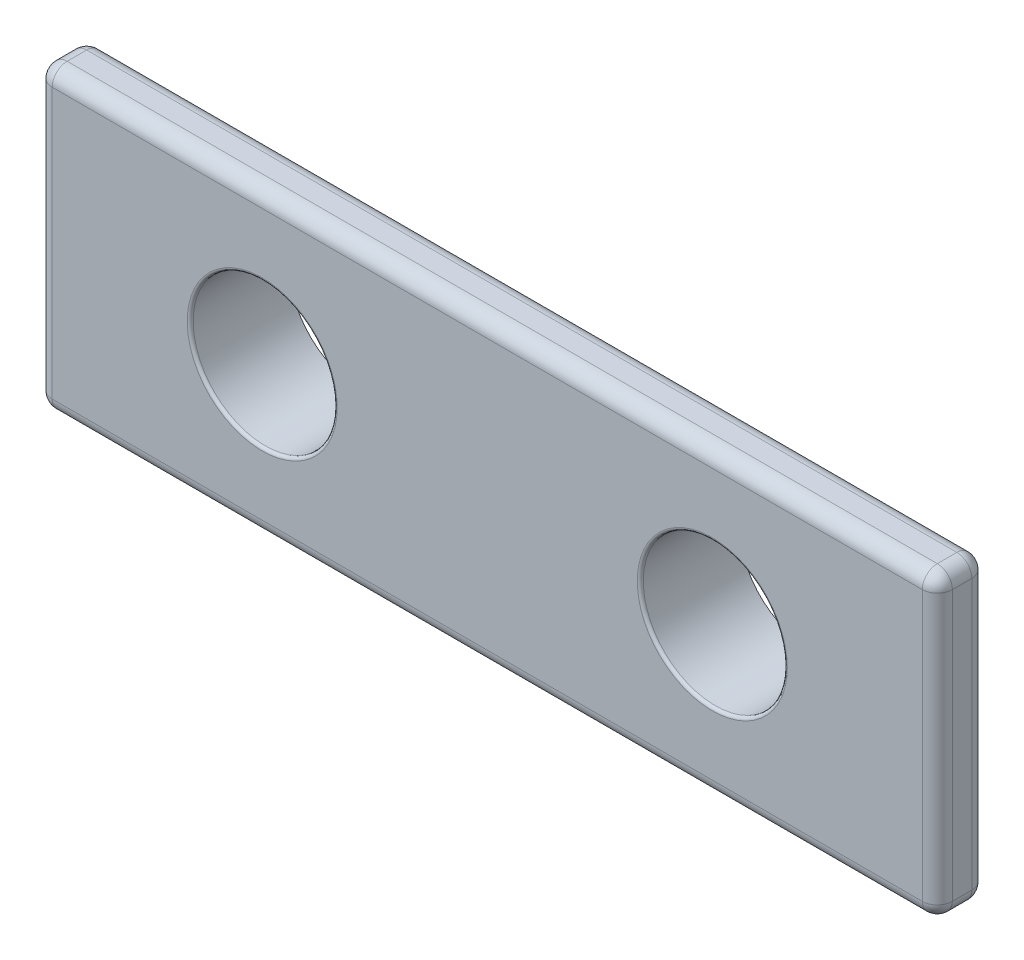
ISO-10303-21;
HEADER;
FILE_DESCRIPTION(('STEP AP214'),'2;1');
FILE_NAME('part.step','',(''),(''),'','','');
FILE_SCHEMA(('AUTOMOTIVE_DESIGN { 1 0 10303 214 1 1 1 1 }'));
ENDSEC;
DATA;
#1=APPLICATION_CONTEXT('core data for automotive mechanical design processes');
#2=APPLICATION_PROTOCOL_DEFINITION('international standard','automotive_design',2000,#1);
#3=PRODUCT_CONTEXT('',#1,'mechanical');
#4=PRODUCT('Part','Part','',(#3));
#5=PRODUCT_RELATED_PRODUCT_CATEGORY('part','',(#4));
#6=PRODUCT_DEFINITION_FORMATION('','',#4);
#7=PRODUCT_DEFINITION_CONTEXT('part definition',#1,'design');
#8=PRODUCT_DEFINITION('design','',#6,#7);
#9=PRODUCT_DEFINITION_SHAPE('','',#8);
#10=(LENGTH_UNIT() NAMED_UNIT(*) SI_UNIT(.MILLI.,.METRE.));
#11=(NAMED_UNIT(*) PLANE_ANGLE_UNIT() SI_UNIT($,.RADIAN.));
#12=(NAMED_UNIT(*) SI_UNIT($,.STERADIAN.) SOLID_ANGLE_UNIT());
#13=UNCERTAINTY_MEASURE_WITH_UNIT(LENGTH_MEASURE(1.E-05),#10,'distance_accuracy_value','');
#14=(GEOMETRIC_REPRESENTATION_CONTEXT(3) GLOBAL_UNCERTAINTY_ASSIGNED_CONTEXT((#13)) GLOBAL_UNIT_ASSIGNED_CONTEXT((#10,
#11,#12)) REPRESENTATION_CONTEXT('',''));
#15=CARTESIAN_POINT('',(0.,0.,0.));
#16=DIRECTION('',(0.,0.,1.));
#17=DIRECTION('',(1.,0.,0.));
#18=AXIS2_PLACEMENT_3D('',#15,#16,#17);
#19=CARTESIAN_POINT('',(0.,0.,1.65));
#20=DIRECTION('',(0.,0.,1.));
#21=DIRECTION('',(1.,0.,0.));
#22=AXIS2_PLACEMENT_3D('',#19,#20,#21);
#23=PLANE('',#22);
#24=CARTESIAN_POINT('',(22.5,4.999,1.65));
#25=DIRECTION('',(0.,0.,1.));
#26=DIRECTION('',(1.,0.,0.));
#27=AXIS2_PLACEMENT_3D('',#24,#25,#26);
#28=CIRCLE('',#27,2.5);
#29=CARTESIAN_POINT('',(25.,4.999,1.65));
#30=VERTEX_POINT('',#29);
#31=EDGE_CURVE('E184',#30,#30,#28,.F.);
#32=ORIENTED_EDGE('',*,*,#31,.T.);
#33=EDGE_LOOP('',(#32));
#34=FACE_BOUND('',#33,.T.);
#35=CARTESIAN_POINT('',(7.5,4.999,1.65));
#36=DIRECTION('',(0.,0.,1.));
#37=DIRECTION('',(1.,0.,0.));
#38=AXIS2_PLACEMENT_3D('',#35,#36,#37);
#39=CIRCLE('',#38,2.5);
#40=CARTESIAN_POINT('',(10.,4.999,1.65));
#41=VERTEX_POINT('',#40);
#42=EDGE_CURVE('E322',#41,#41,#39,.F.);
#43=ORIENTED_EDGE('',*,*,#42,.T.);
#44=EDGE_LOOP('',(#43));
#45=FACE_BOUND('',#44,.T.);
#46=DIRECTION('',(0.,1.,0.));
#47=VECTOR('',#46,1.);
#48=CARTESIAN_POINT('',(0.5,0.,1.65));
#49=LINE('',#48,#47);
#50=CARTESIAN_POINT('',(0.5,9.498,1.65));
#51=VERTEX_POINT('',#50);
#52=CARTESIAN_POINT('',(0.5,0.5,1.65));
#53=VERTEX_POINT('',#52);
#54=EDGE_CURVE('E257',#51,#53,#49,.F.);
#55=ORIENTED_EDGE('',*,*,#54,.T.);
#56=DIRECTION('',(1.,0.,0.));
#57=VECTOR('',#56,1.);
#58=CARTESIAN_POINT('',(29.5,0.5,1.65));
#59=LINE('',#58,#57);
#60=CARTESIAN_POINT('',(29.5,0.5,1.65));
#61=VERTEX_POINT('',#60);
#62=EDGE_CURVE('E135',#53,#61,#59,.T.);
#63=ORIENTED_EDGE('',*,*,#62,.T.);
#64=DIRECTION('',(0.,1.,0.));
#65=VECTOR('',#64,1.);
#66=CARTESIAN_POINT('',(29.5,9.498,1.65));
#67=LINE('',#66,#65);
#68=CARTESIAN_POINT('',(29.5,9.498,1.65));
#69=VERTEX_POINT('',#68);
#70=EDGE_CURVE('E253',#61,#69,#67,.T.);
#71=ORIENTED_EDGE('',*,*,#70,.T.);
#72=DIRECTION('',(1.,0.,0.));
#73=VECTOR('',#72,1.);
#74=CARTESIAN_POINT('',(0.,9.498,1.65));
#75=LINE('',#74,#73);
#76=EDGE_CURVE('E255',#69,#51,#75,.F.);
#77=ORIENTED_EDGE('',*,*,#76,.T.);
#78=EDGE_LOOP('',(#55,#63,#71,#77));
#79=FACE_BOUND('',#78,.T.);
#80=ADVANCED_FACE('F35',(#34,#45,#79),#23,.T.);
#81=CARTESIAN_POINT('',(22.5,4.999,-1.65));
#82=DIRECTION('',(0.,0.,-1.));
#83=DIRECTION('',(1.,0.,0.));
#84=AXIS2_PLACEMENT_3D('',#81,#82,#83);
#85=PLANE('',#84);
#86=CARTESIAN_POINT('',(22.5,4.999,-1.65));
#87=DIRECTION('',(0.,0.,-1.));
#88=DIRECTION('',(-1.,0.,0.));
#89=AXIS2_PLACEMENT_3D('',#86,#87,#88);
#90=CIRCLE('',#89,2.5);
#91=CARTESIAN_POINT('',(20.,4.999,-1.65));
#92=VERTEX_POINT('',#91);
#93=EDGE_CURVE('E43',#92,#92,#90,.T.);
#94=ORIENTED_EDGE('',*,*,#93,.T.);
#95=EDGE_LOOP('',(#94));
#96=FACE_BOUND('',#95,.T.);
#97=CARTESIAN_POINT('',(22.5,4.999,-1.65));
#98=DIRECTION('',(0.,0.,-1.));
#99=DIRECTION('',(-1.,0.,0.));
#100=AXIS2_PLACEMENT_3D('',#97,#98,#99);
#101=CIRCLE('',#100,2.4);
#102=CARTESIAN_POINT('',(20.1,4.999,-1.65));
#103=VERTEX_POINT('',#102);
#104=EDGE_CURVE('E160',#103,#103,#101,.T.);
#105=ORIENTED_EDGE('',*,*,#104,.F.);
#106=EDGE_LOOP('',(#105));
#107=FACE_BOUND('',#106,.T.);
#108=ADVANCED_FACE('F199',(#96,#107),#85,.T.);
#109=CARTESIAN_POINT('',(0.,0.,0.));
#110=DIRECTION('',(0.,0.,1.));
#111=DIRECTION('',(1.,0.,0.));
#112=AXIS2_PLACEMENT_3D('',#109,#110,#111);
#113=PLANE('',#112);
#114=CARTESIAN_POINT('',(22.5,4.999,0.));
#115=DIRECTION('',(0.,0.,1.));
#116=DIRECTION('',(1.,0.,0.));
#117=AXIS2_PLACEMENT_3D('',#114,#115,#116);
#118=CIRCLE('',#117,2.7);
#119=CARTESIAN_POINT('',(25.2,4.999,0.));
#120=VERTEX_POINT('',#119);
#121=EDGE_CURVE('E11',#120,#120,#118,.T.);
#122=ORIENTED_EDGE('',*,*,#121,.T.);
#123=EDGE_LOOP('',(#122));
#124=FACE_BOUND('',#123,.T.);
#125=DIRECTION('',(0.,1.,0.));
#126=VECTOR('',#125,1.);
#127=CARTESIAN_POINT('',(29.5,0.,0.));
#128=LINE('',#127,#126);
#129=CARTESIAN_POINT('',(29.5,9.498,0.));
#130=VERTEX_POINT('',#129);
#131=CARTESIAN_POINT('',(29.5,0.5,0.));
#132=VERTEX_POINT('',#131);
#133=EDGE_CURVE('E224',#130,#132,#128,.F.);
#134=ORIENTED_EDGE('',*,*,#133,.T.);
#135=DIRECTION('',(1.,0.,0.));
#136=VECTOR('',#135,1.);
#137=CARTESIAN_POINT('',(0.,0.5,0.));
#138=LINE('',#137,#136);
#139=CARTESIAN_POINT('',(0.5,0.5,0.));
#140=VERTEX_POINT('',#139);
#141=EDGE_CURVE('E159',#132,#140,#138,.F.);
#142=ORIENTED_EDGE('',*,*,#141,.T.);
#143=DIRECTION('',(0.,1.,0.));
#144=VECTOR('',#143,1.);
#145=CARTESIAN_POINT('',(0.5,9.498,0.));
#146=LINE('',#145,#144);
#147=CARTESIAN_POINT('',(0.5,9.498,0.));
#148=VERTEX_POINT('',#147);
#149=EDGE_CURVE('E58',#140,#148,#146,.T.);
#150=ORIENTED_EDGE('',*,*,#149,.T.);
#151=DIRECTION('',(1.,0.,0.));
#152=VECTOR('',#151,1.);
#153=CARTESIAN_POINT('',(29.5,9.498,0.));
#154=LINE('',#153,#152);
#155=EDGE_CURVE('E283',#148,#130,#154,.T.);
#156=ORIENTED_EDGE('',*,*,#155,.T.);
#157=EDGE_LOOP('',(#134,#142,#150,#156));
#158=FACE_BOUND('',#157,.T.);
#159=CARTESIAN_POINT('',(7.5,4.999,0.));
#160=DIRECTION('',(0.,0.,1.));
#161=DIRECTION('',(1.,0.,0.));
#162=AXIS2_PLACEMENT_3D('',#159,#160,#161);
#163=CIRCLE('',#162,2.7);
#164=CARTESIAN_POINT('',(10.2,4.999,0.));
#165=VERTEX_POINT('',#164);
#166=EDGE_CURVE('E227',#165,#165,#163,.T.);
#167=ORIENTED_EDGE('',*,*,#166,.T.);
#168=EDGE_LOOP('',(#167));
#169=FACE_BOUND('',#168,.T.);
#170=ADVANCED_FACE('F219',(#124,#158,#169),#113,.F.);
#171=CARTESIAN_POINT('',(0.,0.,1.65));
#172=DIRECTION('',(0.,1.,0.));
#173=DIRECTION('',(0.,0.,1.));
#174=AXIS2_PLACEMENT_3D('',#171,#172,#173);
#175=PLANE('',#174);
#176=DIRECTION('',(0.,0.,-1.));
#177=VECTOR('',#176,1.);
#178=CARTESIAN_POINT('',(29.5,0.,1.65));
#179=LINE('',#178,#177);
#180=CARTESIAN_POINT('',(29.5,0.,0.5));
#181=VERTEX_POINT('',#180);
#182=CARTESIAN_POINT('',(29.5,0.,1.15));
#183=VERTEX_POINT('',#182);
#184=EDGE_CURVE('E130',#181,#183,#179,.F.);
#185=ORIENTED_EDGE('',*,*,#184,.T.);
#186=DIRECTION('',(1.,0.,0.));
#187=VECTOR('',#186,1.);
#188=CARTESIAN_POINT('',(0.5,0.,1.15));
#189=LINE('',#188,#187);
#190=CARTESIAN_POINT('',(0.5,0.,1.15));
#191=VERTEX_POINT('',#190);
#192=EDGE_CURVE('E134',#183,#191,#189,.F.);
#193=ORIENTED_EDGE('',*,*,#192,.T.);
#194=DIRECTION('',(0.,0.,-1.));
#195=VECTOR('',#194,1.);
#196=CARTESIAN_POINT('',(0.5,0.,0.));
#197=LINE('',#196,#195);
#198=CARTESIAN_POINT('',(0.5,0.,0.5));
#199=VERTEX_POINT('',#198);
#200=EDGE_CURVE('E132',#191,#199,#197,.T.);
#201=ORIENTED_EDGE('',*,*,#200,.T.);
#202=DIRECTION('',(1.,0.,0.));
#203=VECTOR('',#202,1.);
#204=CARTESIAN_POINT('',(0.,0.,0.5));
#205=LINE('',#204,#203);
#206=EDGE_CURVE('E127',#199,#181,#205,.T.);
#207=ORIENTED_EDGE('',*,*,#206,.T.);
#208=EDGE_LOOP('',(#185,#193,#201,#207));
#209=FACE_BOUND('',#208,.T.);
#210=ADVANCED_FACE('F129',(#209),#175,.F.);
#211=CARTESIAN_POINT('',(30.,0.,1.65));
#212=DIRECTION('',(-1.,0.,0.));
#213=DIRECTION('',(0.,0.,1.));
#214=AXIS2_PLACEMENT_3D('',#211,#212,#213);
#215=PLANE('',#214);
#216=DIRECTION('',(0.,0.,-1.));
#217=VECTOR('',#216,1.);
#218=CARTESIAN_POINT('',(30.,9.498,1.65));
#219=LINE('',#218,#217);
#220=CARTESIAN_POINT('',(30.,9.498,0.5));
#221=VERTEX_POINT('',#220);
#222=CARTESIAN_POINT('',(30.,9.498,1.15));
#223=VERTEX_POINT('',#222);
#224=EDGE_CURVE('E244',#221,#223,#219,.F.);
#225=ORIENTED_EDGE('',*,*,#224,.T.);
#226=DIRECTION('',(0.,1.,0.));
#227=VECTOR('',#226,1.);
#228=CARTESIAN_POINT('',(30.,0.5,1.15));
#229=LINE('',#228,#227);
#230=CARTESIAN_POINT('',(30.,0.5,1.15));
#231=VERTEX_POINT('',#230);
#232=EDGE_CURVE('E188',#223,#231,#229,.F.);
#233=ORIENTED_EDGE('',*,*,#232,.T.);
#234=DIRECTION('',(0.,0.,-1.));
#235=VECTOR('',#234,1.);
#236=CARTESIAN_POINT('',(30.,0.5,1.65));
#237=LINE('',#236,#235);
#238=CARTESIAN_POINT('',(30.,0.5,0.5));
#239=VERTEX_POINT('',#238);
#240=EDGE_CURVE('E242',#231,#239,#237,.T.);
#241=ORIENTED_EDGE('',*,*,#240,.T.);
#242=DIRECTION('',(0.,1.,0.));
#243=VECTOR('',#242,1.);
#244=CARTESIAN_POINT('',(30.,0.,0.5));
#245=LINE('',#244,#243);
#246=EDGE_CURVE('E287',#239,#221,#245,.T.);
#247=ORIENTED_EDGE('',*,*,#246,.T.);
#248=EDGE_LOOP('',(#225,#233,#241,#247));
#249=FACE_BOUND('',#248,.T.);
#250=ADVANCED_FACE('F366',(#249),#215,.F.);
#251=CARTESIAN_POINT('',(0.,9.998,1.65));
#252=DIRECTION('',(0.,1.,0.));
#253=DIRECTION('',(0.,0.,1.));
#254=AXIS2_PLACEMENT_3D('',#251,#252,#253);
#255=PLANE('',#254);
#256=DIRECTION('',(0.,0.,-1.));
#257=VECTOR('',#256,1.);
#258=CARTESIAN_POINT('',(0.5,9.998,1.65));
#259=LINE('',#258,#257);
#260=CARTESIAN_POINT('',(0.5,9.998,0.5));
#261=VERTEX_POINT('',#260);
#262=CARTESIAN_POINT('',(0.5,9.998,1.15));
#263=VERTEX_POINT('',#262);
#264=EDGE_CURVE('E229',#261,#263,#259,.F.);
#265=ORIENTED_EDGE('',*,*,#264,.T.);
#266=DIRECTION('',(1.,0.,0.));
#267=VECTOR('',#266,1.);
#268=CARTESIAN_POINT('',(0.,9.998,1.15));
#269=LINE('',#268,#267);
#270=CARTESIAN_POINT('',(29.5,9.998,1.15));
#271=VERTEX_POINT('',#270);
#272=EDGE_CURVE('E276',#263,#271,#269,.T.);
#273=ORIENTED_EDGE('',*,*,#272,.T.);
#274=DIRECTION('',(0.,0.,-1.));
#275=VECTOR('',#274,1.);
#276=CARTESIAN_POINT('',(29.5,9.998,0.));
#277=LINE('',#276,#275);
#278=CARTESIAN_POINT('',(29.5,9.998,0.5));
#279=VERTEX_POINT('',#278);
#280=EDGE_CURVE('E233',#271,#279,#277,.T.);
#281=ORIENTED_EDGE('',*,*,#280,.T.);
#282=DIRECTION('',(1.,0.,0.));
#283=VECTOR('',#282,1.);
#284=CARTESIAN_POINT('',(0.5,9.998,0.5));
#285=LINE('',#284,#283);
#286=EDGE_CURVE('E274',#279,#261,#285,.F.);
#287=ORIENTED_EDGE('',*,*,#286,.T.);
#288=EDGE_LOOP('',(#265,#273,#281,#287));
#289=FACE_BOUND('',#288,.T.);
#290=ADVANCED_FACE('F362',(#289),#255,.T.);
#291=CARTESIAN_POINT('',(0.,0.,1.65));
#292=DIRECTION('',(-1.,0.,0.));
#293=DIRECTION('',(0.,0.,1.));
#294=AXIS2_PLACEMENT_3D('',#291,#292,#293);
#295=PLANE('',#294);
#296=DIRECTION('',(0.,0.,-1.));
#297=VECTOR('',#296,1.);
#298=CARTESIAN_POINT('',(0.,0.5,1.65));
#299=LINE('',#298,#297);
#300=CARTESIAN_POINT('',(0.,0.5,0.5));
#301=VERTEX_POINT('',#300);
#302=CARTESIAN_POINT('',(0.,0.5,1.15));
#303=VERTEX_POINT('',#302);
#304=EDGE_CURVE('E147',#301,#303,#299,.F.);
#305=ORIENTED_EDGE('',*,*,#304,.T.);
#306=DIRECTION('',(0.,1.,0.));
#307=VECTOR('',#306,1.);
#308=CARTESIAN_POINT('',(0.,0.,1.15));
#309=LINE('',#308,#307);
#310=CARTESIAN_POINT('',(0.,9.498,1.15));
#311=VERTEX_POINT('',#310);
#312=EDGE_CURVE('E268',#303,#311,#309,.T.);
#313=ORIENTED_EDGE('',*,*,#312,.T.);
#314=DIRECTION('',(0.,0.,-1.));
#315=VECTOR('',#314,1.);
#316=CARTESIAN_POINT('',(0.,9.498,1.65));
#317=LINE('',#316,#315);
#318=CARTESIAN_POINT('',(0.,9.498,0.5));
#319=VERTEX_POINT('',#318);
#320=EDGE_CURVE('E156',#311,#319,#317,.T.);
#321=ORIENTED_EDGE('',*,*,#320,.T.);
#322=DIRECTION('',(0.,1.,0.));
#323=VECTOR('',#322,1.);
#324=CARTESIAN_POINT('',(0.,0.5,0.5));
#325=LINE('',#324,#323);
#326=EDGE_CURVE('E266',#319,#301,#325,.F.);
#327=ORIENTED_EDGE('',*,*,#326,.T.);
#328=EDGE_LOOP('',(#305,#313,#321,#327));
#329=FACE_BOUND('',#328,.T.);
#330=ADVANCED_FACE('F359',(#329),#295,.T.);
#331=CARTESIAN_POINT('',(7.5,4.999,-1.65));
#332=DIRECTION('',(0.,0.,1.));
#333=DIRECTION('',(1.,0.,0.));
#334=AXIS2_PLACEMENT_3D('',#331,#332,#333);
#335=CYLINDRICAL_SURFACE('',#334,2.6);
#336=CARTESIAN_POINT('',(7.5,4.999,-1.55));
#337=DIRECTION('',(0.,0.,-1.));
#338=DIRECTION('',(-1.,0.,0.));
#339=AXIS2_PLACEMENT_3D('',#336,#337,#338);
#340=CIRCLE('',#339,2.6);
#341=CARTESIAN_POINT('',(4.9,4.999,-1.55));
#342=VERTEX_POINT('',#341);
#343=EDGE_CURVE('E230',#342,#342,#340,.F.);
#344=ORIENTED_EDGE('',*,*,#343,.T.);
#345=EDGE_LOOP('',(#344));
#346=FACE_BOUND('',#345,.T.);
#347=CARTESIAN_POINT('',(7.5,4.999,-0.1));
#348=DIRECTION('',(0.,0.,1.));
#349=DIRECTION('',(1.,0.,0.));
#350=AXIS2_PLACEMENT_3D('',#347,#348,#349);
#351=CIRCLE('',#350,2.6);
#352=CARTESIAN_POINT('',(10.1,4.999,-0.1));
#353=VERTEX_POINT('',#352);
#354=EDGE_CURVE('E236',#353,#353,#351,.F.);
#355=ORIENTED_EDGE('',*,*,#354,.T.);
#356=EDGE_LOOP('',(#355));
#357=FACE_BOUND('',#356,.T.);
#358=ADVANCED_FACE('F332',(#346,#357),#335,.T.);
#359=CARTESIAN_POINT('',(7.5,4.999,-1.65));
#360=DIRECTION('',(0.,0.,-1.));
#361=DIRECTION('',(-1.,0.,0.));
#362=AXIS2_PLACEMENT_3D('',#359,#360,#361);
#363=PLANE('',#362);
#364=CARTESIAN_POINT('',(7.5,4.999,-1.65));
#365=DIRECTION('',(0.,0.,-1.));
#366=DIRECTION('',(-1.,0.,0.));
#367=AXIS2_PLACEMENT_3D('',#364,#365,#366);
#368=CIRCLE('',#367,2.5);
#369=CARTESIAN_POINT('',(5.,4.999,-1.65));
#370=VERTEX_POINT('',#369);
#371=EDGE_CURVE('E327',#370,#370,#368,.T.);
#372=ORIENTED_EDGE('',*,*,#371,.T.);
#373=EDGE_LOOP('',(#372));
#374=FACE_BOUND('',#373,.T.);
#375=CARTESIAN_POINT('',(7.5,4.999,-1.65));
#376=DIRECTION('',(0.,0.,1.));
#377=DIRECTION('',(1.,0.,0.));
#378=AXIS2_PLACEMENT_3D('',#375,#376,#377);
#379=CIRCLE('',#378,2.4);
#380=CARTESIAN_POINT('',(9.9,4.999,-1.65));
#381=VERTEX_POINT('',#380);
#382=EDGE_CURVE('E312',#381,#381,#379,.T.);
#383=ORIENTED_EDGE('',*,*,#382,.T.);
#384=EDGE_LOOP('',(#383));
#385=FACE_BOUND('',#384,.T.);
#386=ADVANCED_FACE('F379',(#374,#385),#363,.T.);
#387=CARTESIAN_POINT('',(7.5,4.999,-1.65));
#388=DIRECTION('',(0.,0.,1.));
#389=DIRECTION('',(1.,0.,0.));
#390=AXIS2_PLACEMENT_3D('',#387,#388,#389);
#391=CYLINDRICAL_SURFACE('',#390,2.4);
#392=CARTESIAN_POINT('',(7.5,4.999,1.55));
#393=DIRECTION('',(0.,0.,1.));
#394=DIRECTION('',(1.,0.,0.));
#395=AXIS2_PLACEMENT_3D('',#392,#393,#394);
#396=CIRCLE('',#395,2.4);
#397=CARTESIAN_POINT('',(9.9,4.999,1.55));
#398=VERTEX_POINT('',#397);
#399=EDGE_CURVE('E317',#398,#398,#396,.T.);
#400=ORIENTED_EDGE('',*,*,#399,.T.);
#401=EDGE_LOOP('',(#400));
#402=FACE_BOUND('',#401,.T.);
#403=ORIENTED_EDGE('',*,*,#382,.F.);
#404=EDGE_LOOP('',(#403));
#405=FACE_BOUND('',#404,.T.);
#406=ADVANCED_FACE('F374',(#402,#405),#391,.F.);
#407=CARTESIAN_POINT('',(7.5,4.999,1.55));
#408=DIRECTION('',(0.,0.,1.));
#409=DIRECTION('',(1.,0.,0.));
#410=AXIS2_PLACEMENT_3D('',#407,#408,#409);
#411=TOROIDAL_SURFACE('',#410,2.5,0.1);
#412=ORIENTED_EDGE('',*,*,#42,.F.);
#413=EDGE_LOOP('',(#412));
#414=FACE_BOUND('',#413,.T.);
#415=ORIENTED_EDGE('',*,*,#399,.F.);
#416=EDGE_LOOP('',(#415));
#417=FACE_BOUND('',#416,.T.);
#418=ADVANCED_FACE('F345',(#414,#417),#411,.T.);
#419=CARTESIAN_POINT('',(7.5,4.999,-1.55));
#420=DIRECTION('',(0.,0.,-1.));
#421=DIRECTION('',(-1.,0.,0.));
#422=AXIS2_PLACEMENT_3D('',#419,#420,#421);
#423=TOROIDAL_SURFACE('',#422,2.5,0.1);
#424=ORIENTED_EDGE('',*,*,#343,.F.);
#425=EDGE_LOOP('',(#424));
#426=FACE_BOUND('',#425,.T.);
#427=ORIENTED_EDGE('',*,*,#371,.F.);
#428=EDGE_LOOP('',(#427));
#429=FACE_BOUND('',#428,.T.);
#430=ADVANCED_FACE('F337',(#426,#429),#423,.T.);
#431=CARTESIAN_POINT('',(7.5,4.999,-0.1));
#432=DIRECTION('',(0.,0.,1.));
#433=DIRECTION('',(1.,0.,0.));
#434=AXIS2_PLACEMENT_3D('',#431,#432,#433);
#435=TOROIDAL_SURFACE('',#434,2.7,0.1);
#436=ORIENTED_EDGE('',*,*,#166,.F.);
#437=EDGE_LOOP('',(#436));
#438=FACE_BOUND('',#437,.T.);
#439=ORIENTED_EDGE('',*,*,#354,.F.);
#440=EDGE_LOOP('',(#439));
#441=FACE_BOUND('',#440,.T.);
#442=ADVANCED_FACE('F334',(#438,#441),#435,.F.);
#443=CARTESIAN_POINT('',(29.5,9.498,1.65));
#444=DIRECTION('',(0.,0.,1.));
#445=DIRECTION('',(1.,0.,0.));
#446=AXIS2_PLACEMENT_3D('',#443,#444,#445);
#447=CYLINDRICAL_SURFACE('',#446,0.5);
#448=ORIENTED_EDGE('',*,*,#280,.F.);
#449=CARTESIAN_POINT('',(29.5,9.498,1.15));
#450=DIRECTION('',(0.,0.,1.));
#451=DIRECTION('',(1.,0.,0.));
#452=AXIS2_PLACEMENT_3D('',#449,#450,#451);
#453=CIRCLE('',#452,0.5);
#454=EDGE_CURVE('E280',#271,#223,#453,.F.);
#455=ORIENTED_EDGE('',*,*,#454,.T.);
#456=ORIENTED_EDGE('',*,*,#224,.F.);
#457=CARTESIAN_POINT('',(29.5,9.498,0.5));
#458=DIRECTION('',(0.,0.,1.));
#459=DIRECTION('',(1.,0.,0.));
#460=AXIS2_PLACEMENT_3D('',#457,#458,#459);
#461=CIRCLE('',#460,0.5);
#462=EDGE_CURVE('E278',#221,#279,#461,.T.);
#463=ORIENTED_EDGE('',*,*,#462,.T.);
#464=EDGE_LOOP('',(#448,#455,#456,#463));
#465=FACE_BOUND('',#464,.T.);
#466=ADVANCED_FACE('F336',(#465),#447,.T.);
#467=CARTESIAN_POINT('',(29.5,0.5,1.65));
#468=DIRECTION('',(0.,0.,-1.));
#469=DIRECTION('',(-1.,0.,0.));
#470=AXIS2_PLACEMENT_3D('',#467,#468,#469);
#471=CYLINDRICAL_SURFACE('',#470,0.5);
#472=ORIENTED_EDGE('',*,*,#240,.F.);
#473=CARTESIAN_POINT('',(29.5,0.5,1.15));
#474=DIRECTION('',(0.,0.,-1.));
#475=DIRECTION('',(-1.,0.,0.));
#476=AXIS2_PLACEMENT_3D('',#473,#474,#475);
#477=CIRCLE('',#476,0.5);
#478=EDGE_CURVE('E146',#231,#183,#477,.T.);
#479=ORIENTED_EDGE('',*,*,#478,.T.);
#480=ORIENTED_EDGE('',*,*,#184,.F.);
#481=CARTESIAN_POINT('',(29.5,0.5,0.5));
#482=DIRECTION('',(0.,0.,-1.));
#483=DIRECTION('',(-1.,0.,0.));
#484=AXIS2_PLACEMENT_3D('',#481,#482,#483);
#485=CIRCLE('',#484,0.5);
#486=EDGE_CURVE('E143',#181,#239,#485,.F.);
#487=ORIENTED_EDGE('',*,*,#486,.T.);
#488=EDGE_LOOP('',(#472,#479,#480,#487));
#489=FACE_BOUND('',#488,.T.);
#490=ADVANCED_FACE('F142',(#489),#471,.T.);
#491=CARTESIAN_POINT('',(0.5,9.498,1.65));
#492=DIRECTION('',(0.,0.,-1.));
#493=DIRECTION('',(-1.,0.,0.));
#494=AXIS2_PLACEMENT_3D('',#491,#492,#493);
#495=CYLINDRICAL_SURFACE('',#494,0.5);
#496=ORIENTED_EDGE('',*,*,#320,.F.);
#497=CARTESIAN_POINT('',(0.5,9.498,1.15));
#498=DIRECTION('',(0.,0.,-1.));
#499=DIRECTION('',(-1.,0.,0.));
#500=AXIS2_PLACEMENT_3D('',#497,#498,#499);
#501=CIRCLE('',#500,0.5);
#502=EDGE_CURVE('E272',#311,#263,#501,.T.);
#503=ORIENTED_EDGE('',*,*,#502,.T.);
#504=ORIENTED_EDGE('',*,*,#264,.F.);
#505=CARTESIAN_POINT('',(0.5,9.498,0.5));
#506=DIRECTION('',(0.,0.,-1.));
#507=DIRECTION('',(-1.,0.,0.));
#508=AXIS2_PLACEMENT_3D('',#505,#506,#507);
#509=CIRCLE('',#508,0.5);
#510=EDGE_CURVE('E270',#261,#319,#509,.F.);
#511=ORIENTED_EDGE('',*,*,#510,.T.);
#512=EDGE_LOOP('',(#496,#503,#504,#511));
#513=FACE_BOUND('',#512,.T.);
#514=ADVANCED_FACE('F432',(#513),#495,.T.);
#515=CARTESIAN_POINT('',(0.5,0.5,1.65));
#516=DIRECTION('',(0.,0.,1.));
#517=DIRECTION('',(1.,0.,0.));
#518=AXIS2_PLACEMENT_3D('',#515,#516,#517);
#519=CYLINDRICAL_SURFACE('',#518,0.5);
#520=ORIENTED_EDGE('',*,*,#200,.F.);
#521=CARTESIAN_POINT('',(0.5,0.5,1.15));
#522=DIRECTION('',(0.,0.,1.));
#523=DIRECTION('',(1.,0.,0.));
#524=AXIS2_PLACEMENT_3D('',#521,#522,#523);
#525=CIRCLE('',#524,0.5);
#526=EDGE_CURVE('E264',#191,#303,#525,.F.);
#527=ORIENTED_EDGE('',*,*,#526,.T.);
#528=ORIENTED_EDGE('',*,*,#304,.F.);
#529=CARTESIAN_POINT('',(0.5,0.5,0.5));
#530=DIRECTION('',(0.,0.,1.));
#531=DIRECTION('',(1.,0.,0.));
#532=AXIS2_PLACEMENT_3D('',#529,#530,#531);
#533=CIRCLE('',#532,0.5);
#534=EDGE_CURVE('E262',#301,#199,#533,.T.);
#535=ORIENTED_EDGE('',*,*,#534,.T.);
#536=EDGE_LOOP('',(#520,#527,#528,#535));
#537=FACE_BOUND('',#536,.T.);
#538=ADVANCED_FACE('F437',(#537),#519,.T.);
#539=CARTESIAN_POINT('',(0.5,9.498,1.15));
#540=DIRECTION('',(0.,0.,1.));
#541=DIRECTION('',(1.,0.,0.));
#542=AXIS2_PLACEMENT_3D('',#539,#540,#541);
#543=SPHERICAL_SURFACE('',#542,0.5);
#544=CARTESIAN_POINT('',(0.5,9.498,1.15));
#545=DIRECTION('',(1.,0.,0.));
#546=DIRECTION('',(0.,0.,-1.));
#547=AXIS2_PLACEMENT_3D('',#544,#545,#546);
#548=CIRCLE('',#547,0.5);
#549=EDGE_CURVE('E304',#263,#51,#548,.T.);
#550=ORIENTED_EDGE('',*,*,#549,.F.);
#551=ORIENTED_EDGE('',*,*,#502,.F.);
#552=CARTESIAN_POINT('',(0.5,9.498,1.15));
#553=DIRECTION('',(0.,-1.,0.));
#554=DIRECTION('',(0.,0.,-1.));
#555=AXIS2_PLACEMENT_3D('',#552,#553,#554);
#556=CIRCLE('',#555,0.5);
#557=EDGE_CURVE('E166',#51,#311,#556,.T.);
#558=ORIENTED_EDGE('',*,*,#557,.F.);
#559=EDGE_LOOP('',(#550,#551,#558));
#560=FACE_BOUND('',#559,.T.);
#561=ADVANCED_FACE('F630',(#560),#543,.T.);
#562=CARTESIAN_POINT('',(0.5,0.,1.15));
#563=DIRECTION('',(0.,1.,0.));
#564=DIRECTION('',(0.,0.,1.));
#565=AXIS2_PLACEMENT_3D('',#562,#563,#564);
#566=CYLINDRICAL_SURFACE('',#565,0.5);
#567=ORIENTED_EDGE('',*,*,#557,.T.);
#568=ORIENTED_EDGE('',*,*,#312,.F.);
#569=CARTESIAN_POINT('',(0.5,0.5,1.15));
#570=DIRECTION('',(0.,-1.,0.));
#571=DIRECTION('',(0.,0.,-1.));
#572=AXIS2_PLACEMENT_3D('',#569,#570,#571);
#573=CIRCLE('',#572,0.5);
#574=EDGE_CURVE('E302',#53,#303,#573,.T.);
#575=ORIENTED_EDGE('',*,*,#574,.F.);
#576=ORIENTED_EDGE('',*,*,#54,.F.);
#577=EDGE_LOOP('',(#567,#568,#575,#576));
#578=FACE_BOUND('',#577,.T.);
#579=ADVANCED_FACE('F390',(#578),#566,.T.);
#580=CARTESIAN_POINT('',(0.,9.498,1.15));
#581=DIRECTION('',(1.,0.,0.));
#582=DIRECTION('',(0.,0.,-1.));
#583=AXIS2_PLACEMENT_3D('',#580,#581,#582);
#584=CYLINDRICAL_SURFACE('',#583,0.5);
#585=ORIENTED_EDGE('',*,*,#549,.T.);
#586=ORIENTED_EDGE('',*,*,#76,.F.);
#587=CARTESIAN_POINT('',(29.5,9.498,1.15));
#588=DIRECTION('',(1.,0.,0.));
#589=DIRECTION('',(0.,0.,-1.));
#590=AXIS2_PLACEMENT_3D('',#587,#588,#589);
#591=CIRCLE('',#590,0.5);
#592=EDGE_CURVE('E299',#271,#69,#591,.T.);
#593=ORIENTED_EDGE('',*,*,#592,.F.);
#594=ORIENTED_EDGE('',*,*,#272,.F.);
#595=EDGE_LOOP('',(#585,#586,#593,#594));
#596=FACE_BOUND('',#595,.T.);
#597=ADVANCED_FACE('F406',(#596),#584,.T.);
#598=CARTESIAN_POINT('',(0.5,0.5,1.15));
#599=DIRECTION('',(0.,0.,1.));
#600=DIRECTION('',(1.,0.,0.));
#601=AXIS2_PLACEMENT_3D('',#598,#599,#600);
#602=SPHERICAL_SURFACE('',#601,0.5);
#603=ORIENTED_EDGE('',*,*,#574,.T.);
#604=ORIENTED_EDGE('',*,*,#526,.F.);
#605=CARTESIAN_POINT('',(0.5,0.5,1.15));
#606=DIRECTION('',(1.,0.,0.));
#607=DIRECTION('',(0.,0.,-1.));
#608=AXIS2_PLACEMENT_3D('',#605,#606,#607);
#609=CIRCLE('',#608,0.5);
#610=EDGE_CURVE('E296',#53,#191,#609,.T.);
#611=ORIENTED_EDGE('',*,*,#610,.F.);
#612=EDGE_LOOP('',(#603,#604,#611));
#613=FACE_BOUND('',#612,.T.);
#614=ADVANCED_FACE('F393',(#613),#602,.T.);
#615=CARTESIAN_POINT('',(29.5,9.498,1.15));
#616=DIRECTION('',(0.,0.,1.));
#617=DIRECTION('',(1.,0.,0.));
#618=AXIS2_PLACEMENT_3D('',#615,#616,#617);
#619=SPHERICAL_SURFACE('',#618,0.5);
#620=ORIENTED_EDGE('',*,*,#454,.F.);
#621=ORIENTED_EDGE('',*,*,#592,.T.);
#622=CARTESIAN_POINT('',(29.5,9.498,1.15));
#623=DIRECTION('',(0.,-1.,0.));
#624=DIRECTION('',(0.,0.,-1.));
#625=AXIS2_PLACEMENT_3D('',#622,#623,#624);
#626=CIRCLE('',#625,0.5);
#627=EDGE_CURVE('E293',#223,#69,#626,.T.);
#628=ORIENTED_EDGE('',*,*,#627,.F.);
#629=EDGE_LOOP('',(#620,#621,#628));
#630=FACE_BOUND('',#629,.T.);
#631=ADVANCED_FACE('F409',(#630),#619,.T.);
#632=CARTESIAN_POINT('',(0.,0.5,1.15));
#633=DIRECTION('',(-1.,0.,0.));
#634=DIRECTION('',(0.,0.,1.));
#635=AXIS2_PLACEMENT_3D('',#632,#633,#634);
#636=CYLINDRICAL_SURFACE('',#635,0.5);
#637=ORIENTED_EDGE('',*,*,#610,.T.);
#638=ORIENTED_EDGE('',*,*,#192,.F.);
#639=CARTESIAN_POINT('',(29.5,0.5,1.15));
#640=DIRECTION('',(1.,0.,0.));
#641=DIRECTION('',(0.,0.,-1.));
#642=AXIS2_PLACEMENT_3D('',#639,#640,#641);
#643=CIRCLE('',#642,0.5);
#644=EDGE_CURVE('E291',#61,#183,#643,.T.);
#645=ORIENTED_EDGE('',*,*,#644,.F.);
#646=ORIENTED_EDGE('',*,*,#62,.F.);
#647=EDGE_LOOP('',(#637,#638,#645,#646));
#648=FACE_BOUND('',#647,.T.);
#649=ADVANCED_FACE('F397',(#648),#636,.T.);
#650=CARTESIAN_POINT('',(29.5,0.,1.15));
#651=DIRECTION('',(0.,-1.,0.));
#652=DIRECTION('',(0.,0.,-1.));
#653=AXIS2_PLACEMENT_3D('',#650,#651,#652);
#654=CYLINDRICAL_SURFACE('',#653,0.5);
#655=ORIENTED_EDGE('',*,*,#627,.T.);
#656=ORIENTED_EDGE('',*,*,#70,.F.);
#657=CARTESIAN_POINT('',(29.5,0.5,1.15));
#658=DIRECTION('',(0.,-1.,0.));
#659=DIRECTION('',(0.,0.,-1.));
#660=AXIS2_PLACEMENT_3D('',#657,#658,#659);
#661=CIRCLE('',#660,0.5);
#662=EDGE_CURVE('E183',#231,#61,#661,.T.);
#663=ORIENTED_EDGE('',*,*,#662,.F.);
#664=ORIENTED_EDGE('',*,*,#232,.F.);
#665=EDGE_LOOP('',(#655,#656,#663,#664));
#666=FACE_BOUND('',#665,.T.);
#667=ADVANCED_FACE('F402',(#666),#654,.T.);
#668=CARTESIAN_POINT('',(29.5,0.5,1.15));
#669=DIRECTION('',(0.,0.,1.));
#670=DIRECTION('',(1.,0.,0.));
#671=AXIS2_PLACEMENT_3D('',#668,#669,#670);
#672=SPHERICAL_SURFACE('',#671,0.5);
#673=ORIENTED_EDGE('',*,*,#644,.T.);
#674=ORIENTED_EDGE('',*,*,#478,.F.);
#675=ORIENTED_EDGE('',*,*,#662,.T.);
#676=EDGE_LOOP('',(#673,#674,#675));
#677=FACE_BOUND('',#676,.T.);
#678=ADVANCED_FACE('F459',(#677),#672,.T.);
#679=CARTESIAN_POINT('',(0.5,9.498,0.5));
#680=DIRECTION('',(0.,0.,1.));
#681=DIRECTION('',(1.,0.,0.));
#682=AXIS2_PLACEMENT_3D('',#679,#680,#681);
#683=SPHERICAL_SURFACE('',#682,0.5);
#684=CARTESIAN_POINT('',(0.5,9.498,0.5));
#685=DIRECTION('',(0.,-1.,0.));
#686=DIRECTION('',(0.,0.,-1.));
#687=AXIS2_PLACEMENT_3D('',#684,#685,#686);
#688=CIRCLE('',#687,0.5);
#689=EDGE_CURVE('E178',#319,#148,#688,.T.);
#690=ORIENTED_EDGE('',*,*,#689,.F.);
#691=ORIENTED_EDGE('',*,*,#510,.F.);
#692=CARTESIAN_POINT('',(0.5,9.498,0.5));
#693=DIRECTION('',(1.,0.,0.));
#694=DIRECTION('',(0.,0.,-1.));
#695=AXIS2_PLACEMENT_3D('',#692,#693,#694);
#696=CIRCLE('',#695,0.5);
#697=EDGE_CURVE('E180',#148,#261,#696,.T.);
#698=ORIENTED_EDGE('',*,*,#697,.F.);
#699=EDGE_LOOP('',(#690,#691,#698));
#700=FACE_BOUND('',#699,.T.);
#701=ADVANCED_FACE('F428',(#700),#683,.T.);
#702=CARTESIAN_POINT('',(0.,9.498,0.5));
#703=DIRECTION('',(-1.,0.,0.));
#704=DIRECTION('',(0.,0.,1.));
#705=AXIS2_PLACEMENT_3D('',#702,#703,#704);
#706=CYLINDRICAL_SURFACE('',#705,0.5);
#707=ORIENTED_EDGE('',*,*,#697,.T.);
#708=ORIENTED_EDGE('',*,*,#286,.F.);
#709=CARTESIAN_POINT('',(29.5,9.498,0.5));
#710=DIRECTION('',(1.,0.,0.));
#711=DIRECTION('',(0.,0.,-1.));
#712=AXIS2_PLACEMENT_3D('',#709,#710,#711);
#713=CIRCLE('',#712,0.5);
#714=EDGE_CURVE('E175',#130,#279,#713,.T.);
#715=ORIENTED_EDGE('',*,*,#714,.F.);
#716=ORIENTED_EDGE('',*,*,#155,.F.);
#717=EDGE_LOOP('',(#707,#708,#715,#716));
#718=FACE_BOUND('',#717,.T.);
#719=ADVANCED_FACE('F422',(#718),#706,.T.);
#720=CARTESIAN_POINT('',(0.5,0.,0.5));
#721=DIRECTION('',(0.,-1.,0.));
#722=DIRECTION('',(0.,0.,-1.));
#723=AXIS2_PLACEMENT_3D('',#720,#721,#722);
#724=CYLINDRICAL_SURFACE('',#723,0.5);
#725=ORIENTED_EDGE('',*,*,#689,.T.);
#726=ORIENTED_EDGE('',*,*,#149,.F.);
#727=CARTESIAN_POINT('',(0.5,0.5,0.5));
#728=DIRECTION('',(0.,-1.,0.));
#729=DIRECTION('',(0.,0.,-1.));
#730=AXIS2_PLACEMENT_3D('',#727,#728,#729);
#731=CIRCLE('',#730,0.5);
#732=EDGE_CURVE('E173',#301,#140,#731,.T.);
#733=ORIENTED_EDGE('',*,*,#732,.F.);
#734=ORIENTED_EDGE('',*,*,#326,.F.);
#735=EDGE_LOOP('',(#725,#726,#733,#734));
#736=FACE_BOUND('',#735,.T.);
#737=ADVANCED_FACE('F440',(#736),#724,.T.);
#738=CARTESIAN_POINT('',(29.5,9.498,0.5));
#739=DIRECTION('',(0.,0.,1.));
#740=DIRECTION('',(1.,0.,0.));
#741=AXIS2_PLACEMENT_3D('',#738,#739,#740);
#742=SPHERICAL_SURFACE('',#741,0.5);
#743=ORIENTED_EDGE('',*,*,#714,.T.);
#744=ORIENTED_EDGE('',*,*,#462,.F.);
#745=CARTESIAN_POINT('',(29.5,9.498,0.5));
#746=DIRECTION('',(0.,-1.,0.));
#747=DIRECTION('',(0.,0.,-1.));
#748=AXIS2_PLACEMENT_3D('',#745,#746,#747);
#749=CIRCLE('',#748,0.5);
#750=EDGE_CURVE('E170',#130,#221,#749,.T.);
#751=ORIENTED_EDGE('',*,*,#750,.F.);
#752=EDGE_LOOP('',(#743,#744,#751));
#753=FACE_BOUND('',#752,.T.);
#754=ADVANCED_FACE('F417',(#753),#742,.T.);
#755=CARTESIAN_POINT('',(0.5,0.5,0.5));
#756=DIRECTION('',(0.,0.,1.));
#757=DIRECTION('',(1.,0.,0.));
#758=AXIS2_PLACEMENT_3D('',#755,#756,#757);
#759=SPHERICAL_SURFACE('',#758,0.5);
#760=ORIENTED_EDGE('',*,*,#534,.F.);
#761=ORIENTED_EDGE('',*,*,#732,.T.);
#762=CARTESIAN_POINT('',(0.5,0.5,0.5));
#763=DIRECTION('',(1.,0.,0.));
#764=DIRECTION('',(0.,0.,-1.));
#765=AXIS2_PLACEMENT_3D('',#762,#763,#764);
#766=CIRCLE('',#765,0.5);
#767=EDGE_CURVE('E50',#199,#140,#766,.T.);
#768=ORIENTED_EDGE('',*,*,#767,.F.);
#769=EDGE_LOOP('',(#760,#761,#768));
#770=FACE_BOUND('',#769,.T.);
#771=ADVANCED_FACE('F442',(#770),#759,.T.);
#772=CARTESIAN_POINT('',(29.5,0.,0.5));
#773=DIRECTION('',(0.,1.,0.));
#774=DIRECTION('',(0.,0.,1.));
#775=AXIS2_PLACEMENT_3D('',#772,#773,#774);
#776=CYLINDRICAL_SURFACE('',#775,0.5);
#777=ORIENTED_EDGE('',*,*,#750,.T.);
#778=ORIENTED_EDGE('',*,*,#246,.F.);
#779=CARTESIAN_POINT('',(29.5,0.5,0.5));
#780=DIRECTION('',(0.,-1.,0.));
#781=DIRECTION('',(0.,0.,-1.));
#782=AXIS2_PLACEMENT_3D('',#779,#780,#781);
#783=CIRCLE('',#782,0.5);
#784=EDGE_CURVE('E154',#132,#239,#783,.T.);
#785=ORIENTED_EDGE('',*,*,#784,.F.);
#786=ORIENTED_EDGE('',*,*,#133,.F.);
#787=EDGE_LOOP('',(#777,#778,#785,#786));
#788=FACE_BOUND('',#787,.T.);
#789=ADVANCED_FACE('F414',(#788),#776,.T.);
#790=CARTESIAN_POINT('',(0.,0.5,0.5));
#791=DIRECTION('',(1.,0.,0.));
#792=DIRECTION('',(0.,0.,-1.));
#793=AXIS2_PLACEMENT_3D('',#790,#791,#792);
#794=CYLINDRICAL_SURFACE('',#793,0.5);
#795=ORIENTED_EDGE('',*,*,#767,.T.);
#796=ORIENTED_EDGE('',*,*,#141,.F.);
#797=CARTESIAN_POINT('',(29.5,0.5,0.5));
#798=DIRECTION('',(1.,0.,0.));
#799=DIRECTION('',(0.,0.,-1.));
#800=AXIS2_PLACEMENT_3D('',#797,#798,#799);
#801=CIRCLE('',#800,0.5);
#802=EDGE_CURVE('E152',#181,#132,#801,.T.);
#803=ORIENTED_EDGE('',*,*,#802,.F.);
#804=ORIENTED_EDGE('',*,*,#206,.F.);
#805=EDGE_LOOP('',(#795,#796,#803,#804));
#806=FACE_BOUND('',#805,.T.);
#807=ADVANCED_FACE('F158',(#806),#794,.T.);
#808=CARTESIAN_POINT('',(29.5,0.5,0.5));
#809=DIRECTION('',(0.,0.,1.));
#810=DIRECTION('',(1.,0.,0.));
#811=AXIS2_PLACEMENT_3D('',#808,#809,#810);
#812=SPHERICAL_SURFACE('',#811,0.5);
#813=ORIENTED_EDGE('',*,*,#784,.T.);
#814=ORIENTED_EDGE('',*,*,#486,.F.);
#815=ORIENTED_EDGE('',*,*,#802,.T.);
#816=EDGE_LOOP('',(#813,#814,#815));
#817=FACE_BOUND('',#816,.T.);
#818=ADVANCED_FACE('F151',(#817),#812,.T.);
#819=CARTESIAN_POINT('',(22.5,4.999,-1.65));
#820=DIRECTION('',(0.,0.,1.));
#821=DIRECTION('',(1.,0.,0.));
#822=AXIS2_PLACEMENT_3D('',#819,#820,#821);
#823=CYLINDRICAL_SURFACE('',#822,2.6);
#824=CARTESIAN_POINT('',(22.5,4.999,-1.55));
#825=DIRECTION('',(0.,0.,-1.));
#826=DIRECTION('',(-1.,0.,0.));
#827=AXIS2_PLACEMENT_3D('',#824,#825,#826);
#828=CIRCLE('',#827,2.6);
#829=CARTESIAN_POINT('',(19.9,4.999,-1.55));
#830=VERTEX_POINT('',#829);
#831=EDGE_CURVE('E194',#830,#830,#828,.F.);
#832=ORIENTED_EDGE('',*,*,#831,.T.);
#833=EDGE_LOOP('',(#832));
#834=FACE_BOUND('',#833,.T.);
#835=CARTESIAN_POINT('',(22.5,4.999,-0.1));
#836=DIRECTION('',(0.,0.,1.));
#837=DIRECTION('',(1.,0.,0.));
#838=AXIS2_PLACEMENT_3D('',#835,#836,#837);
#839=CIRCLE('',#838,2.6);
#840=CARTESIAN_POINT('',(25.1,4.999,-0.1));
#841=VERTEX_POINT('',#840);
#842=EDGE_CURVE('E191',#841,#841,#839,.F.);
#843=ORIENTED_EDGE('',*,*,#842,.T.);
#844=EDGE_LOOP('',(#843));
#845=FACE_BOUND('',#844,.T.);
#846=ADVANCED_FACE('F208',(#834,#845),#823,.T.);
#847=CARTESIAN_POINT('',(22.5,4.999,-1.65));
#848=DIRECTION('',(0.,0.,1.));
#849=DIRECTION('',(1.,0.,0.));
#850=AXIS2_PLACEMENT_3D('',#847,#848,#849);
#851=CYLINDRICAL_SURFACE('',#850,2.4);
#852=CARTESIAN_POINT('',(22.5,4.999,1.55));
#853=DIRECTION('',(0.,0.,1.));
#854=DIRECTION('',(1.,0.,0.));
#855=AXIS2_PLACEMENT_3D('',#852,#853,#854);
#856=CIRCLE('',#855,2.4);
#857=CARTESIAN_POINT('',(24.9,4.999,1.55));
#858=VERTEX_POINT('',#857);
#859=EDGE_CURVE('E187',#858,#858,#856,.T.);
#860=ORIENTED_EDGE('',*,*,#859,.T.);
#861=EDGE_LOOP('',(#860));
#862=FACE_BOUND('',#861,.T.);
#863=ORIENTED_EDGE('',*,*,#104,.T.);
#864=EDGE_LOOP('',(#863));
#865=FACE_BOUND('',#864,.T.);
#866=ADVANCED_FACE('F211',(#862,#865),#851,.F.);
#867=CARTESIAN_POINT('',(22.5,4.999,1.55));
#868=DIRECTION('',(0.,0.,1.));
#869=DIRECTION('',(1.,0.,0.));
#870=AXIS2_PLACEMENT_3D('',#867,#868,#869);
#871=TOROIDAL_SURFACE('',#870,2.5,0.1);
#872=ORIENTED_EDGE('',*,*,#859,.F.);
#873=EDGE_LOOP('',(#872));
#874=FACE_BOUND('',#873,.T.);
#875=ORIENTED_EDGE('',*,*,#31,.F.);
#876=EDGE_LOOP('',(#875));
#877=FACE_BOUND('',#876,.T.);
#878=ADVANCED_FACE('F205',(#874,#877),#871,.T.);
#879=CARTESIAN_POINT('',(22.5,4.999,-1.55));
#880=DIRECTION('',(0.,0.,-1.));
#881=DIRECTION('',(-1.,0.,0.));
#882=AXIS2_PLACEMENT_3D('',#879,#880,#881);
#883=TOROIDAL_SURFACE('',#882,2.5,0.1);
#884=ORIENTED_EDGE('',*,*,#93,.F.);
#885=EDGE_LOOP('',(#884));
#886=FACE_BOUND('',#885,.T.);
#887=ORIENTED_EDGE('',*,*,#831,.F.);
#888=EDGE_LOOP('',(#887));
#889=FACE_BOUND('',#888,.T.);
#890=ADVANCED_FACE('F202',(#886,#889),#883,.T.);
#891=CARTESIAN_POINT('',(22.5,4.999,-0.1));
#892=DIRECTION('',(0.,0.,1.));
#893=DIRECTION('',(1.,0.,0.));
#894=AXIS2_PLACEMENT_3D('',#891,#892,#893);
#895=TOROIDAL_SURFACE('',#894,2.7,0.1);
#896=ORIENTED_EDGE('',*,*,#842,.F.);
#897=EDGE_LOOP('',(#896));
#898=FACE_BOUND('',#897,.T.);
#899=ORIENTED_EDGE('',*,*,#121,.F.);
#900=EDGE_LOOP('',(#899));
#901=FACE_BOUND('',#900,.T.);
#902=ADVANCED_FACE('F37',(#898,#901),#895,.F.);
#903=CLOSED_SHELL('',(#80,#108,#170,#210,#250,#290,#330,#358,#386,#406,#418,#430,#442,#466,#490,
#514,#538,#561,#579,#597,#614,#631,#649,#667,#678,#701,#719,#737,#754,#771,#789,#807,#818,#846,
#866,#878,#890,#902));
#904=MANIFOLD_SOLID_BREP('B2',#903);
#905=ADVANCED_BREP_SHAPE_REPRESENTATION('',(#18,#904),#14);
#906=SHAPE_DEFINITION_REPRESENTATION(#9,#905);
ENDSEC;
END-ISO-10303-21;
